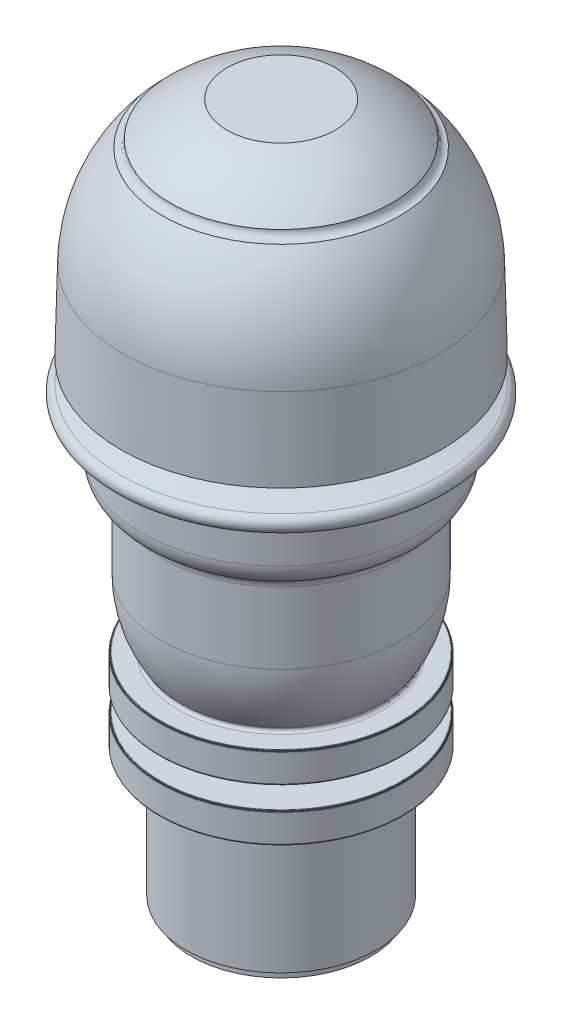
ISO-10303-21;
HEADER;
FILE_DESCRIPTION(('STEP AP214'),'2;1');
FILE_NAME('part.step','',(''),(''),'','','');
FILE_SCHEMA(('AUTOMOTIVE_DESIGN { 1 0 10303 214 1 1 1 1 }'));
ENDSEC;
DATA;
#1=APPLICATION_CONTEXT('core data for automotive mechanical design processes');
#2=APPLICATION_PROTOCOL_DEFINITION('international standard','automotive_design',2000,#1);
#3=PRODUCT_CONTEXT('',#1,'mechanical');
#4=PRODUCT('Part','Part','',(#3));
#5=PRODUCT_RELATED_PRODUCT_CATEGORY('part','',(#4));
#6=PRODUCT_DEFINITION_FORMATION('','',#4);
#7=PRODUCT_DEFINITION_CONTEXT('part definition',#1,'design');
#8=PRODUCT_DEFINITION('design','',#6,#7);
#9=PRODUCT_DEFINITION_SHAPE('','',#8);
#10=(LENGTH_UNIT() NAMED_UNIT(*) SI_UNIT(.MILLI.,.METRE.));
#11=(NAMED_UNIT(*) PLANE_ANGLE_UNIT() SI_UNIT($,.RADIAN.));
#12=(NAMED_UNIT(*) SI_UNIT($,.STERADIAN.) SOLID_ANGLE_UNIT());
#13=UNCERTAINTY_MEASURE_WITH_UNIT(LENGTH_MEASURE(1.E-05),#10,'distance_accuracy_value','');
#14=(GEOMETRIC_REPRESENTATION_CONTEXT(3) GLOBAL_UNCERTAINTY_ASSIGNED_CONTEXT((#13)) GLOBAL_UNIT_ASSIGNED_CONTEXT((#10,
#11,#12)) REPRESENTATION_CONTEXT('',''));
#15=CARTESIAN_POINT('',(0.,0.,0.));
#16=DIRECTION('',(0.,0.,1.));
#17=DIRECTION('',(1.,0.,0.));
#18=AXIS2_PLACEMENT_3D('',#15,#16,#17);
#19=CARTESIAN_POINT('',(0.,86.4,0.));
#20=DIRECTION('',(0.,1.,0.));
#21=DIRECTION('',(0.,0.,1.));
#22=AXIS2_PLACEMENT_3D('',#19,#20,#21);
#23=PLANE('',#22);
#24=CARTESIAN_POINT('',(0.,86.4,0.));
#25=DIRECTION('',(0.,-1.,0.));
#26=DIRECTION('',(0.,0.,-1.));
#27=AXIS2_PLACEMENT_3D('',#24,#25,#26);
#28=CIRCLE('',#27,16.5928828550973);
#29=CARTESIAN_POINT('',(0.,86.4,-16.5928828550973));
#30=VERTEX_POINT('',#29);
#31=EDGE_CURVE('E10',#30,#30,#28,.T.);
#32=ORIENTED_EDGE('',*,*,#31,.F.);
#33=EDGE_LOOP('',(#32));
#34=FACE_BOUND('',#33,.T.);
#35=CARTESIAN_POINT('',(0.,86.4,0.));
#36=DIRECTION('',(0.,-1.,0.));
#37=DIRECTION('',(0.,0.,-1.));
#38=AXIS2_PLACEMENT_3D('',#35,#36,#37);
#39=CIRCLE('',#38,29.1686005690508);
#40=CARTESIAN_POINT('',(0.,86.4,-29.1686005690508));
#41=VERTEX_POINT('',#40);
#42=EDGE_CURVE('E193',#41,#41,#39,.T.);
#43=ORIENTED_EDGE('',*,*,#42,.T.);
#44=EDGE_LOOP('',(#43));
#45=FACE_BOUND('',#44,.T.);
#46=ADVANCED_FACE('F36',(#34,#45),#23,.F.);
#47=CARTESIAN_POINT('',(0.,85.8,0.));
#48=DIRECTION('',(0.,-1.,0.));
#49=DIRECTION('',(0.,0.,-1.));
#50=AXIS2_PLACEMENT_3D('',#47,#48,#49);
#51=TOROIDAL_SURFACE('',#50,17.3928828550973,1.);
#52=ORIENTED_EDGE('',*,*,#31,.T.);
#53=EDGE_LOOP('',(#52));
#54=FACE_BOUND('',#53,.T.);
#55=CARTESIAN_POINT('',(0.,84.8,0.));
#56=DIRECTION('',(0.,-1.,0.));
#57=DIRECTION('',(0.,0.,-1.));
#58=AXIS2_PLACEMENT_3D('',#55,#56,#57);
#59=CIRCLE('',#58,17.3928828550973);
#60=CARTESIAN_POINT('',(0.,84.8,-17.3928828550973));
#61=VERTEX_POINT('',#60);
#62=EDGE_CURVE('E42',#61,#61,#59,.T.);
#63=ORIENTED_EDGE('',*,*,#62,.F.);
#64=EDGE_LOOP('',(#63));
#65=FACE_BOUND('',#64,.T.);
#66=ADVANCED_FACE('F210',(#54,#65),#51,.F.);
#67=CARTESIAN_POINT('',(0.,84.8,0.));
#68=DIRECTION('',(0.,1.,0.));
#69=DIRECTION('',(0.,0.,1.));
#70=AXIS2_PLACEMENT_3D('',#67,#68,#69);
#71=PLANE('',#70);
#72=ORIENTED_EDGE('',*,*,#62,.T.);
#73=EDGE_LOOP('',(#72));
#74=FACE_BOUND('',#73,.T.);
#75=CARTESIAN_POINT('',(0.,84.8,0.));
#76=DIRECTION('',(0.,-1.,0.));
#77=DIRECTION('',(0.,0.,-1.));
#78=AXIS2_PLACEMENT_3D('',#75,#76,#77);
#79=CIRCLE('',#78,20.0084396633131);
#80=CARTESIAN_POINT('',(0.,84.8,-20.0084396633131));
#81=VERTEX_POINT('',#80);
#82=EDGE_CURVE('E46',#81,#81,#79,.T.);
#83=ORIENTED_EDGE('',*,*,#82,.F.);
#84=EDGE_LOOP('',(#83));
#85=FACE_BOUND('',#84,.T.);
#86=ADVANCED_FACE('F215',(#74,#85),#71,.T.);
#87=CARTESIAN_POINT('',(0.,82.3488887394336,0.));
#88=DIRECTION('',(0.,-1.,0.));
#89=DIRECTION('',(0.,0.,-1.));
#90=AXIS2_PLACEMENT_3D('',#87,#88,#89);
#91=CONICAL_SURFACE('',#90,29.1561114227511,1.30899693899575);
#92=ORIENTED_EDGE('',*,*,#82,.T.);
#93=EDGE_LOOP('',(#92));
#94=FACE_BOUND('',#93,.T.);
#95=CARTESIAN_POINT('',(0.,82.3488887394336,0.));
#96=DIRECTION('',(0.,-1.,0.));
#97=DIRECTION('',(0.,0.,-1.));
#98=AXIS2_PLACEMENT_3D('',#95,#96,#97);
#99=CIRCLE('',#98,29.1561114227511);
#100=CARTESIAN_POINT('',(0.,82.3488887394336,-29.1561114227511));
#101=VERTEX_POINT('',#100);
#102=EDGE_CURVE('E50',#101,#101,#99,.T.);
#103=ORIENTED_EDGE('',*,*,#102,.F.);
#104=EDGE_LOOP('',(#103));
#105=FACE_BOUND('',#104,.T.);
#106=ADVANCED_FACE('F219',(#94,#105),#91,.T.);
#107=CARTESIAN_POINT('',(0.,80.9,0.));
#108=DIRECTION('',(0.,-1.,0.));
#109=DIRECTION('',(0.,0.,-1.));
#110=AXIS2_PLACEMENT_3D('',#107,#108,#109);
#111=TOROIDAL_SURFACE('',#110,28.7678828550973,1.5);
#112=CARTESIAN_POINT('',(0.,79.4511112605664,0.));
#113=DIRECTION('',(0.,-1.,0.));
#114=DIRECTION('',(0.,0.,-1.));
#115=AXIS2_PLACEMENT_3D('',#112,#113,#114);
#116=CIRCLE('',#115,28.3796542874435);
#117=CARTESIAN_POINT('',(0.,79.4511112605664,-28.3796542874435));
#118=VERTEX_POINT('',#117);
#119=EDGE_CURVE('E55',#118,#118,#116,.T.);
#120=ORIENTED_EDGE('',*,*,#119,.F.);
#121=EDGE_LOOP('',(#120));
#122=FACE_BOUND('',#121,.T.);
#123=ORIENTED_EDGE('',*,*,#102,.T.);
#124=EDGE_LOOP('',(#123));
#125=FACE_BOUND('',#124,.T.);
#126=ADVANCED_FACE('F225',(#122,#125),#111,.T.);
#127=CARTESIAN_POINT('',(0.,79.4511112605664,0.));
#128=DIRECTION('',(0.,-1.,0.));
#129=DIRECTION('',(0.,0.,-1.));
#130=AXIS2_PLACEMENT_3D('',#127,#128,#129);
#131=PLANE('',#130);
#132=ORIENTED_EDGE('',*,*,#119,.T.);
#133=EDGE_LOOP('',(#132));
#134=FACE_BOUND('',#133,.T.);
#135=CARTESIAN_POINT('',(0.,79.4511112605664,0.));
#136=DIRECTION('',(0.,-1.,0.));
#137=DIRECTION('',(0.,0.,-1.));
#138=AXIS2_PLACEMENT_3D('',#135,#136,#137);
#139=CIRCLE('',#138,22.6665233690671);
#140=CARTESIAN_POINT('',(0.,79.4511112605664,-22.6665233690671));
#141=VERTEX_POINT('',#140);
#142=EDGE_CURVE('E58',#141,#141,#139,.T.);
#143=ORIENTED_EDGE('',*,*,#142,.F.);
#144=EDGE_LOOP('',(#143));
#145=FACE_BOUND('',#144,.T.);
#146=ADVANCED_FACE('F229',(#134,#145),#131,.T.);
#147=CARTESIAN_POINT('',(0.,77.,0.));
#148=DIRECTION('',(0.,1.,0.));
#149=DIRECTION('',(0.,0.,1.));
#150=AXIS2_PLACEMENT_3D('',#147,#148,#149);
#151=CONICAL_SURFACE('',#150,22.6237390628676,0.017453292519945);
#152=ORIENTED_EDGE('',*,*,#142,.T.);
#153=EDGE_LOOP('',(#152));
#154=FACE_BOUND('',#153,.T.);
#155=CARTESIAN_POINT('',(0.,77.,0.));
#156=DIRECTION('',(0.,-1.,0.));
#157=DIRECTION('',(0.,0.,-1.));
#158=AXIS2_PLACEMENT_3D('',#155,#156,#157);
#159=CIRCLE('',#158,22.6237390628676);
#160=CARTESIAN_POINT('',(0.,77.,-22.6237390628676));
#161=VERTEX_POINT('',#160);
#162=EDGE_CURVE('E61',#161,#161,#159,.T.);
#163=ORIENTED_EDGE('',*,*,#162,.F.);
#164=EDGE_LOOP('',(#163));
#165=FACE_BOUND('',#164,.T.);
#166=ADVANCED_FACE('F233',(#154,#165),#151,.T.);
#167=CARTESIAN_POINT('',(0.,77.,0.));
#168=DIRECTION('',(0.,1.,0.));
#169=DIRECTION('',(0.,0.,1.));
#170=AXIS2_PLACEMENT_3D('',#167,#168,#169);
#171=PLANE('',#170);
#172=ORIENTED_EDGE('',*,*,#162,.T.);
#173=EDGE_LOOP('',(#172));
#174=FACE_BOUND('',#173,.T.);
#175=CARTESIAN_POINT('',(0.,77.,0.));
#176=DIRECTION('',(0.,-1.,0.));
#177=DIRECTION('',(0.,0.,-1.));
#178=AXIS2_PLACEMENT_3D('',#175,#176,#177);
#179=CIRCLE('',#178,25.4678828550973);
#180=CARTESIAN_POINT('',(0.,77.,-25.4678828550973));
#181=VERTEX_POINT('',#180);
#182=EDGE_CURVE('E64',#181,#181,#179,.T.);
#183=ORIENTED_EDGE('',*,*,#182,.F.);
#184=EDGE_LOOP('',(#183));
#185=FACE_BOUND('',#184,.T.);
#186=ADVANCED_FACE('F237',(#174,#185),#171,.T.);
#187=CARTESIAN_POINT('',(0.,0.,0.));
#188=DIRECTION('',(0.,-1.,0.));
#189=DIRECTION('',(0.,0.,-1.));
#190=AXIS2_PLACEMENT_3D('',#187,#188,#189);
#191=CYLINDRICAL_SURFACE('',#190,25.4678828550973);
#192=ORIENTED_EDGE('',*,*,#182,.T.);
#193=EDGE_LOOP('',(#192));
#194=FACE_BOUND('',#193,.T.);
#195=CARTESIAN_POINT('',(0.,71.4418746991013,0.));
#196=DIRECTION('',(0.,-1.,0.));
#197=DIRECTION('',(0.,0.,-1.));
#198=AXIS2_PLACEMENT_3D('',#195,#196,#197);
#199=CIRCLE('',#198,25.4678828550973);
#200=CARTESIAN_POINT('',(0.,71.4418746991013,-25.4678828550973));
#201=VERTEX_POINT('',#200);
#202=EDGE_CURVE('E67',#201,#201,#199,.T.);
#203=ORIENTED_EDGE('',*,*,#202,.F.);
#204=EDGE_LOOP('',(#203));
#205=FACE_BOUND('',#204,.T.);
#206=ADVANCED_FACE('F241',(#194,#205),#191,.T.);
#207=CARTESIAN_POINT('',(0.,71.4418746991013,0.));
#208=DIRECTION('',(0.,-1.,0.));
#209=DIRECTION('',(0.,0.,-1.));
#210=AXIS2_PLACEMENT_3D('',#207,#208,#209);
#211=TOROIDAL_SURFACE('',#210,20.9678828550973,4.5);
#212=CARTESIAN_POINT('',(0.,67.3974999074158,0.));
#213=DIRECTION('',(0.,-1.,0.));
#214=DIRECTION('',(0.,0.,-1.));
#215=AXIS2_PLACEMENT_3D('',#212,#213,#214);
#216=CIRCLE('',#215,22.9409597781742);
#217=CARTESIAN_POINT('',(0.,67.3974999074158,-22.9409597781742));
#218=VERTEX_POINT('',#217);
#219=EDGE_CURVE('E70',#218,#218,#216,.T.);
#220=ORIENTED_EDGE('',*,*,#219,.F.);
#221=EDGE_LOOP('',(#220));
#222=FACE_BOUND('',#221,.T.);
#223=ORIENTED_EDGE('',*,*,#202,.T.);
#224=EDGE_LOOP('',(#223));
#225=FACE_BOUND('',#224,.T.);
#226=ADVANCED_FACE('F245',(#222,#225),#211,.T.);
#227=CARTESIAN_POINT('',(0.,65.6,0.));
#228=DIRECTION('',(0.,-1.,0.));
#229=DIRECTION('',(0.,0.,-1.));
#230=AXIS2_PLACEMENT_3D('',#227,#228,#229);
#231=TOROIDAL_SURFACE('',#230,23.8178828550973,2.00000000000001);
#232=ORIENTED_EDGE('',*,*,#219,.T.);
#233=EDGE_LOOP('',(#232));
#234=FACE_BOUND('',#233,.T.);
#235=CARTESIAN_POINT('',(0.,65.6,0.));
#236=DIRECTION('',(0.,-1.,0.));
#237=DIRECTION('',(0.,0.,-1.));
#238=AXIS2_PLACEMENT_3D('',#235,#236,#237);
#239=CIRCLE('',#238,21.8178828550973);
#240=CARTESIAN_POINT('',(0.,65.6,-21.8178828550973));
#241=VERTEX_POINT('',#240);
#242=EDGE_CURVE('E73',#241,#241,#239,.T.);
#243=ORIENTED_EDGE('',*,*,#242,.F.);
#244=EDGE_LOOP('',(#243));
#245=FACE_BOUND('',#244,.T.);
#246=ADVANCED_FACE('F249',(#234,#245),#231,.F.);
#247=CARTESIAN_POINT('',(0.,0.,0.));
#248=DIRECTION('',(0.,-1.,0.));
#249=DIRECTION('',(0.,0.,-1.));
#250=AXIS2_PLACEMENT_3D('',#247,#248,#249);
#251=CYLINDRICAL_SURFACE('',#250,21.8178828550973);
#252=ORIENTED_EDGE('',*,*,#242,.T.);
#253=EDGE_LOOP('',(#252));
#254=FACE_BOUND('',#253,.T.);
#255=CARTESIAN_POINT('',(0.,52.6,0.));
#256=DIRECTION('',(0.,-1.,0.));
#257=DIRECTION('',(0.,0.,-1.));
#258=AXIS2_PLACEMENT_3D('',#255,#256,#257);
#259=CIRCLE('',#258,21.8178828550973);
#260=CARTESIAN_POINT('',(0.,52.6,-21.8178828550973));
#261=VERTEX_POINT('',#260);
#262=EDGE_CURVE('E76',#261,#261,#259,.T.);
#263=ORIENTED_EDGE('',*,*,#262,.F.);
#264=EDGE_LOOP('',(#263));
#265=FACE_BOUND('',#264,.T.);
#266=ADVANCED_FACE('F253',(#254,#265),#251,.T.);
#267=CARTESIAN_POINT('',(0.,52.6,0.));
#268=DIRECTION('',(0.,-1.,0.));
#269=DIRECTION('',(0.,0.,-1.));
#270=AXIS2_PLACEMENT_3D('',#267,#268,#269);
#271=DEGENERATE_TOROIDAL_SURFACE('',#270,0.817882855097306,21.,.T.);
#272=CARTESIAN_POINT('',(0.,40.842601268836,0.));
#273=DIRECTION('',(0.,-1.,0.));
#274=DIRECTION('',(0.,0.,-1.));
#275=AXIS2_PLACEMENT_3D('',#272,#273,#274);
#276=CIRCLE('',#275,18.2179855868752);
#277=CARTESIAN_POINT('',(0.,40.842601268836,-18.2179855868752));
#278=VERTEX_POINT('',#277);
#279=EDGE_CURVE('E79',#278,#278,#276,.T.);
#280=ORIENTED_EDGE('',*,*,#279,.F.);
#281=EDGE_LOOP('',(#280));
#282=FACE_BOUND('',#281,.T.);
#283=ORIENTED_EDGE('',*,*,#262,.T.);
#284=EDGE_LOOP('',(#283));
#285=FACE_BOUND('',#284,.T.);
#286=ADVANCED_FACE('F257',(#282,#285),#271,.T.);
#287=CARTESIAN_POINT('',(0.,40.5626632038083,0.));
#288=DIRECTION('',(0.,-1.,0.));
#289=DIRECTION('',(0.,0.,-1.));
#290=AXIS2_PLACEMENT_3D('',#287,#288,#289);
#291=TOROIDAL_SURFACE('',#290,18.6322737471556,0.500000000000004);
#292=ORIENTED_EDGE('',*,*,#279,.T.);
#293=EDGE_LOOP('',(#292));
#294=FACE_BOUND('',#293,.T.);
#295=CARTESIAN_POINT('',(0.,40.0627393562301,0.));
#296=DIRECTION('',(0.,-1.,0.));
#297=DIRECTION('',(0.,0.,-1.));
#298=AXIS2_PLACEMENT_3D('',#295,#296,#297);
#299=CIRCLE('',#298,18.6235475439369);
#300=CARTESIAN_POINT('',(0.,40.0627393562301,-18.6235475439369));
#301=VERTEX_POINT('',#300);
#302=EDGE_CURVE('E82',#301,#301,#299,.T.);
#303=ORIENTED_EDGE('',*,*,#302,.F.);
#304=EDGE_LOOP('',(#303));
#305=FACE_BOUND('',#304,.T.);
#306=ADVANCED_FACE('F261',(#294,#305),#291,.F.);
#307=CARTESIAN_POINT('',(0.,40.0055248976688,0.));
#308=DIRECTION('',(0.,-1.,0.));
#309=DIRECTION('',(0.,0.,-1.));
#310=AXIS2_PLACEMENT_3D('',#307,#308,#309);
#311=CONICAL_SURFACE('',#310,21.9013616796362,1.55334303427495);
#312=ORIENTED_EDGE('',*,*,#302,.T.);
#313=EDGE_LOOP('',(#312));
#314=FACE_BOUND('',#313,.T.);
#315=CARTESIAN_POINT('',(0.,40.0055248976688,0.));
#316=DIRECTION('',(0.,-1.,0.));
#317=DIRECTION('',(0.,0.,-1.));
#318=AXIS2_PLACEMENT_3D('',#315,#316,#317);
#319=CIRCLE('',#318,21.9013616796362);
#320=CARTESIAN_POINT('',(0.,40.0055248976688,-21.9013616796362));
#321=VERTEX_POINT('',#320);
#322=EDGE_CURVE('E85',#321,#321,#319,.T.);
#323=ORIENTED_EDGE('',*,*,#322,.F.);
#324=EDGE_LOOP('',(#323));
#325=FACE_BOUND('',#324,.T.);
#326=ADVANCED_FACE('F265',(#314,#325),#311,.T.);
#327=CARTESIAN_POINT('',(0.,40.0002670414808,0.));
#328=DIRECTION('',(0.,-1.,0.));
#329=DIRECTION('',(0.,0.,-1.));
#330=AXIS2_PLACEMENT_3D('',#327,#328,#329);
#331=CONICAL_SURFACE('',#330,21.9522864506437,1.46791335499196);
#332=ORIENTED_EDGE('',*,*,#322,.T.);
#333=EDGE_LOOP('',(#332));
#334=FACE_BOUND('',#333,.T.);
#335=CARTESIAN_POINT('',(0.,40.0002670414808,0.));
#336=DIRECTION('',(0.,-1.,0.));
#337=DIRECTION('',(0.,0.,-1.));
#338=AXIS2_PLACEMENT_3D('',#335,#336,#337);
#339=CIRCLE('',#338,21.9522864506437);
#340=CARTESIAN_POINT('',(0.,40.0002670414808,-21.9522864506437));
#341=VERTEX_POINT('',#340);
#342=EDGE_CURVE('E88',#341,#341,#339,.T.);
#343=ORIENTED_EDGE('',*,*,#342,.F.);
#344=EDGE_LOOP('',(#343));
#345=FACE_BOUND('',#344,.T.);
#346=ADVANCED_FACE('F269',(#334,#345),#331,.T.);
#347=CARTESIAN_POINT('',(0.,39.9808856316948,0.));
#348=DIRECTION('',(0.,-1.,0.));
#349=DIRECTION('',(0.,0.,-1.));
#350=AXIS2_PLACEMENT_3D('',#347,#348,#349);
#351=CONICAL_SURFACE('',#350,22.0152965385256,1.27238887314194);
#352=ORIENTED_EDGE('',*,*,#342,.T.);
#353=EDGE_LOOP('',(#352));
#354=FACE_BOUND('',#353,.T.);
#355=CARTESIAN_POINT('',(0.,39.9808856316948,0.));
#356=DIRECTION('',(0.,-1.,0.));
#357=DIRECTION('',(0.,0.,-1.));
#358=AXIS2_PLACEMENT_3D('',#355,#356,#357);
#359=CIRCLE('',#358,22.0152965385256);
#360=CARTESIAN_POINT('',(0.,39.9808856316948,-22.0152965385256));
#361=VERTEX_POINT('',#360);
#362=EDGE_CURVE('E91',#361,#361,#359,.T.);
#363=ORIENTED_EDGE('',*,*,#362,.F.);
#364=EDGE_LOOP('',(#363));
#365=FACE_BOUND('',#364,.T.);
#366=ADVANCED_FACE('F273',(#354,#365),#351,.T.);
#367=CARTESIAN_POINT('',(0.,39.9173216632381,0.));
#368=DIRECTION('',(0.,-1.,0.));
#369=DIRECTION('',(0.,0.,-1.));
#370=AXIS2_PLACEMENT_3D('',#367,#368,#369);
#371=CONICAL_SURFACE('',#370,22.1086382693734,0.972948989446623);
#372=ORIENTED_EDGE('',*,*,#362,.T.);
#373=EDGE_LOOP('',(#372));
#374=FACE_BOUND('',#373,.T.);
#375=CARTESIAN_POINT('',(0.,39.9173216632381,0.));
#376=DIRECTION('',(0.,-1.,0.));
#377=DIRECTION('',(0.,0.,-1.));
#378=AXIS2_PLACEMENT_3D('',#375,#376,#377);
#379=CIRCLE('',#378,22.1086382693734);
#380=CARTESIAN_POINT('',(0.,39.9173216632381,-22.1086382693734));
#381=VERTEX_POINT('',#380);
#382=EDGE_CURVE('E94',#381,#381,#379,.T.);
#383=ORIENTED_EDGE('',*,*,#382,.F.);
#384=EDGE_LOOP('',(#383));
#385=FACE_BOUND('',#384,.T.);
#386=ADVANCED_FACE('F277',(#374,#385),#371,.T.);
#387=CARTESIAN_POINT('',(0.,39.8198372626149,0.));
#388=DIRECTION('',(0.,-1.,0.));
#389=DIRECTION('',(0.,0.,-1.));
#390=AXIS2_PLACEMENT_3D('',#387,#388,#389);
#391=CONICAL_SURFACE('',#390,22.1735121998456,0.587180697156547);
#392=ORIENTED_EDGE('',*,*,#382,.T.);
#393=EDGE_LOOP('',(#392));
#394=FACE_BOUND('',#393,.T.);
#395=CARTESIAN_POINT('',(0.,39.8198372626149,0.));
#396=DIRECTION('',(0.,-1.,0.));
#397=DIRECTION('',(0.,0.,-1.));
#398=AXIS2_PLACEMENT_3D('',#395,#396,#397);
#399=CIRCLE('',#398,22.1735121998456);
#400=CARTESIAN_POINT('',(0.,39.8198372626149,-22.1735121998456));
#401=VERTEX_POINT('',#400);
#402=EDGE_CURVE('E97',#401,#401,#399,.T.);
#403=ORIENTED_EDGE('',*,*,#402,.F.);
#404=EDGE_LOOP('',(#403));
#405=FACE_BOUND('',#404,.T.);
#406=ADVANCED_FACE('F281',(#394,#405),#391,.T.);
#407=CARTESIAN_POINT('',(0.,39.7055705891219,0.));
#408=DIRECTION('',(0.,-1.,0.));
#409=DIRECTION('',(0.,0.,-1.));
#410=AXIS2_PLACEMENT_3D('',#407,#408,#409);
#411=CONICAL_SURFACE('',#410,22.196125957705,0.195378742997937);
#412=ORIENTED_EDGE('',*,*,#402,.T.);
#413=EDGE_LOOP('',(#412));
#414=FACE_BOUND('',#413,.T.);
#415=CARTESIAN_POINT('',(0.,39.7055705891219,0.));
#416=DIRECTION('',(0.,-1.,0.));
#417=DIRECTION('',(0.,0.,-1.));
#418=AXIS2_PLACEMENT_3D('',#415,#416,#417);
#419=CIRCLE('',#418,22.196125957705);
#420=CARTESIAN_POINT('',(0.,39.7055705891219,-22.196125957705));
#421=VERTEX_POINT('',#420);
#422=EDGE_CURVE('E100',#421,#421,#419,.T.);
#423=ORIENTED_EDGE('',*,*,#422,.F.);
#424=EDGE_LOOP('',(#423));
#425=FACE_BOUND('',#424,.T.);
#426=ADVANCED_FACE('F285',(#414,#425),#411,.T.);
#427=CARTESIAN_POINT('',(0.,0.,0.));
#428=DIRECTION('',(0.,-1.,0.));
#429=DIRECTION('',(0.,0.,-1.));
#430=AXIS2_PLACEMENT_3D('',#427,#428,#429);
#431=CYLINDRICAL_SURFACE('',#430,22.196125957705);
#432=ORIENTED_EDGE('',*,*,#422,.T.);
#433=EDGE_LOOP('',(#432));
#434=FACE_BOUND('',#433,.T.);
#435=CARTESIAN_POINT('',(0.,34.7944294108781,0.));
#436=DIRECTION('',(0.,-1.,0.));
#437=DIRECTION('',(0.,0.,-1.));
#438=AXIS2_PLACEMENT_3D('',#435,#436,#437);
#439=CIRCLE('',#438,22.196125957705);
#440=CARTESIAN_POINT('',(0.,34.7944294108781,-22.196125957705));
#441=VERTEX_POINT('',#440);
#442=EDGE_CURVE('E103',#441,#441,#439,.T.);
#443=ORIENTED_EDGE('',*,*,#442,.F.);
#444=EDGE_LOOP('',(#443));
#445=FACE_BOUND('',#444,.T.);
#446=ADVANCED_FACE('F289',(#434,#445),#431,.T.);
#447=CARTESIAN_POINT('',(0.,34.6896853430446,0.));
#448=DIRECTION('',(0.,1.,0.));
#449=DIRECTION('',(0.,0.,1.));
#450=AXIS2_PLACEMENT_3D('',#447,#448,#449);
#451=CONICAL_SURFACE('',#450,22.1772463594081,0.178330274257542);
#452=ORIENTED_EDGE('',*,*,#442,.T.);
#453=EDGE_LOOP('',(#452));
#454=FACE_BOUND('',#453,.T.);
#455=CARTESIAN_POINT('',(0.,34.6896853430446,0.));
#456=DIRECTION('',(0.,-1.,0.));
#457=DIRECTION('',(0.,0.,-1.));
#458=AXIS2_PLACEMENT_3D('',#455,#456,#457);
#459=CIRCLE('',#458,22.1772463594081);
#460=CARTESIAN_POINT('',(0.,34.6896853430446,-22.1772463594081));
#461=VERTEX_POINT('',#460);
#462=EDGE_CURVE('E106',#461,#461,#459,.T.);
#463=ORIENTED_EDGE('',*,*,#462,.F.);
#464=EDGE_LOOP('',(#463));
#465=FACE_BOUND('',#464,.T.);
#466=ADVANCED_FACE('F293',(#454,#465),#451,.T.);
#467=CARTESIAN_POINT('',(0.,34.5978693844927,0.));
#468=DIRECTION('',(0.,1.,0.));
#469=DIRECTION('',(0.,0.,1.));
#470=AXIS2_PLACEMENT_3D('',#467,#468,#469);
#471=CONICAL_SURFACE('',#470,22.122762574401,0.535553997991472);
#472=ORIENTED_EDGE('',*,*,#462,.T.);
#473=EDGE_LOOP('',(#472));
#474=FACE_BOUND('',#473,.T.);
#475=CARTESIAN_POINT('',(0.,34.5978693844927,0.));
#476=DIRECTION('',(0.,-1.,0.));
#477=DIRECTION('',(0.,0.,-1.));
#478=AXIS2_PLACEMENT_3D('',#475,#476,#477);
#479=CIRCLE('',#478,22.122762574401);
#480=CARTESIAN_POINT('',(0.,34.5978693844927,-22.122762574401));
#481=VERTEX_POINT('',#480);
#482=EDGE_CURVE('E109',#481,#481,#479,.T.);
#483=ORIENTED_EDGE('',*,*,#482,.F.);
#484=EDGE_LOOP('',(#483));
#485=FACE_BOUND('',#484,.T.);
#486=ADVANCED_FACE('F297',(#474,#485),#471,.T.);
#487=CARTESIAN_POINT('',(0.,34.52553838472,0.));
#488=DIRECTION('',(0.,1.,0.));
#489=DIRECTION('',(0.,0.,1.));
#490=AXIS2_PLACEMENT_3D('',#487,#488,#489);
#491=CONICAL_SURFACE('',#490,22.0291583449333,0.912904652505147);
#492=ORIENTED_EDGE('',*,*,#482,.T.);
#493=EDGE_LOOP('',(#492));
#494=FACE_BOUND('',#493,.T.);
#495=CARTESIAN_POINT('',(0.,34.52553838472,0.));
#496=DIRECTION('',(0.,-1.,0.));
#497=DIRECTION('',(0.,0.,-1.));
#498=AXIS2_PLACEMENT_3D('',#495,#496,#497);
#499=CIRCLE('',#498,22.0291583449333);
#500=CARTESIAN_POINT('',(0.,34.52553838472,-22.0291583449333));
#501=VERTEX_POINT('',#500);
#502=EDGE_CURVE('E112',#501,#501,#499,.T.);
#503=ORIENTED_EDGE('',*,*,#502,.F.);
#504=EDGE_LOOP('',(#503));
#505=FACE_BOUND('',#504,.T.);
#506=ADVANCED_FACE('F301',(#494,#505),#491,.T.);
#507=CARTESIAN_POINT('',(0.,34.5006329195239,0.));
#508=DIRECTION('',(0.,1.,0.));
#509=DIRECTION('',(0.,0.,1.));
#510=AXIS2_PLACEMENT_3D('',#507,#508,#509);
#511=CONICAL_SURFACE('',#510,21.9568188046308,1.23922129046299);
#512=ORIENTED_EDGE('',*,*,#502,.T.);
#513=EDGE_LOOP('',(#512));
#514=FACE_BOUND('',#513,.T.);
#515=CARTESIAN_POINT('',(0.,34.5006329195239,0.));
#516=DIRECTION('',(0.,-1.,0.));
#517=DIRECTION('',(0.,0.,-1.));
#518=AXIS2_PLACEMENT_3D('',#515,#516,#517);
#519=CIRCLE('',#518,21.9568188046308);
#520=CARTESIAN_POINT('',(0.,34.5006329195239,-21.9568188046308));
#521=VERTEX_POINT('',#520);
#522=EDGE_CURVE('E115',#521,#521,#519,.T.);
#523=ORIENTED_EDGE('',*,*,#522,.F.);
#524=EDGE_LOOP('',(#523));
#525=FACE_BOUND('',#524,.T.);
#526=ADVANCED_FACE('F305',(#514,#525),#511,.T.);
#527=CARTESIAN_POINT('',(0.,34.4944751023312,0.));
#528=DIRECTION('',(0.,1.,0.));
#529=DIRECTION('',(0.,0.,1.));
#530=AXIS2_PLACEMENT_3D('',#527,#528,#529);
#531=CONICAL_SURFACE('',#530,21.9013616796362,1.46021187882888);
#532=ORIENTED_EDGE('',*,*,#522,.T.);
#533=EDGE_LOOP('',(#532));
#534=FACE_BOUND('',#533,.T.);
#535=CARTESIAN_POINT('',(0.,34.4944751023312,0.));
#536=DIRECTION('',(0.,-1.,0.));
#537=DIRECTION('',(0.,0.,-1.));
#538=AXIS2_PLACEMENT_3D('',#535,#536,#537);
#539=CIRCLE('',#538,21.9013616796362);
#540=CARTESIAN_POINT('',(0.,34.4944751023312,-21.9013616796362));
#541=VERTEX_POINT('',#540);
#542=EDGE_CURVE('E118',#541,#541,#539,.T.);
#543=ORIENTED_EDGE('',*,*,#542,.F.);
#544=EDGE_LOOP('',(#543));
#545=FACE_BOUND('',#544,.T.);
#546=ADVANCED_FACE('F309',(#534,#545),#531,.T.);
#547=CARTESIAN_POINT('',(0.,34.3628863504472,0.));
#548=DIRECTION('',(0.,1.,0.));
#549=DIRECTION('',(0.,0.,1.));
#550=AXIS2_PLACEMENT_3D('',#547,#548,#549);
#551=CONICAL_SURFACE('',#550,14.3626471331661,1.55334303427495);
#552=ORIENTED_EDGE('',*,*,#542,.T.);
#553=EDGE_LOOP('',(#552));
#554=FACE_BOUND('',#553,.T.);
#555=CARTESIAN_POINT('',(0.,34.3628863504472,0.));
#556=DIRECTION('',(0.,-1.,0.));
#557=DIRECTION('',(0.,0.,-1.));
#558=AXIS2_PLACEMENT_3D('',#555,#556,#557);
#559=CIRCLE('',#558,14.3626471331661);
#560=CARTESIAN_POINT('',(0.,34.3628863504472,-14.3626471331661));
#561=VERTEX_POINT('',#560);
#562=EDGE_CURVE('E121',#561,#561,#559,.T.);
#563=ORIENTED_EDGE('',*,*,#562,.F.);
#564=EDGE_LOOP('',(#563));
#565=FACE_BOUND('',#564,.T.);
#566=ADVANCED_FACE('F313',(#554,#565),#551,.T.);
#567=CARTESIAN_POINT('',(0.,34.0629320419003,0.));
#568=DIRECTION('',(0.,-1.,0.));
#569=DIRECTION('',(0.,0.,-1.));
#570=AXIS2_PLACEMENT_3D('',#567,#568,#569);
#571=TOROIDAL_SURFACE('',#570,14.3678828550973,0.3);
#572=ORIENTED_EDGE('',*,*,#562,.T.);
#573=EDGE_LOOP('',(#572));
#574=FACE_BOUND('',#573,.T.);
#575=CARTESIAN_POINT('',(0.,34.0629320419003,0.));
#576=DIRECTION('',(0.,-1.,0.));
#577=DIRECTION('',(0.,0.,-1.));
#578=AXIS2_PLACEMENT_3D('',#575,#576,#577);
#579=CIRCLE('',#578,14.0678828550973);
#580=CARTESIAN_POINT('',(0.,34.0629320419003,-14.0678828550973));
#581=VERTEX_POINT('',#580);
#582=EDGE_CURVE('E124',#581,#581,#579,.T.);
#583=ORIENTED_EDGE('',*,*,#582,.F.);
#584=EDGE_LOOP('',(#583));
#585=FACE_BOUND('',#584,.T.);
#586=ADVANCED_FACE('F317',(#574,#585),#571,.F.);
#587=CARTESIAN_POINT('',(0.,0.,0.));
#588=DIRECTION('',(0.,-1.,0.));
#589=DIRECTION('',(0.,0.,-1.));
#590=AXIS2_PLACEMENT_3D('',#587,#588,#589);
#591=CYLINDRICAL_SURFACE('',#590,14.0678828550973);
#592=ORIENTED_EDGE('',*,*,#582,.T.);
#593=EDGE_LOOP('',(#592));
#594=FACE_BOUND('',#593,.T.);
#595=CARTESIAN_POINT('',(0.,30.9370679580997,0.));
#596=DIRECTION('',(0.,-1.,0.));
#597=DIRECTION('',(0.,0.,-1.));
#598=AXIS2_PLACEMENT_3D('',#595,#596,#597);
#599=CIRCLE('',#598,14.0678828550973);
#600=CARTESIAN_POINT('',(0.,30.9370679580997,-14.0678828550973));
#601=VERTEX_POINT('',#600);
#602=EDGE_CURVE('E127',#601,#601,#599,.T.);
#603=ORIENTED_EDGE('',*,*,#602,.F.);
#604=EDGE_LOOP('',(#603));
#605=FACE_BOUND('',#604,.T.);
#606=ADVANCED_FACE('F321',(#594,#605),#591,.T.);
#607=CARTESIAN_POINT('',(0.,30.9370679580997,0.));
#608=DIRECTION('',(0.,-1.,0.));
#609=DIRECTION('',(0.,0.,-1.));
#610=AXIS2_PLACEMENT_3D('',#607,#608,#609);
#611=TOROIDAL_SURFACE('',#610,14.3678828550973,0.299999999999999);
#612=ORIENTED_EDGE('',*,*,#602,.T.);
#613=EDGE_LOOP('',(#612));
#614=FACE_BOUND('',#613,.T.);
#615=CARTESIAN_POINT('',(0.,30.6371136495528,0.));
#616=DIRECTION('',(0.,-1.,0.));
#617=DIRECTION('',(0.,0.,-1.));
#618=AXIS2_PLACEMENT_3D('',#615,#616,#617);
#619=CIRCLE('',#618,14.3626471331661);
#620=CARTESIAN_POINT('',(0.,30.6371136495528,-14.3626471331661));
#621=VERTEX_POINT('',#620);
#622=EDGE_CURVE('E130',#621,#621,#619,.T.);
#623=ORIENTED_EDGE('',*,*,#622,.F.);
#624=EDGE_LOOP('',(#623));
#625=FACE_BOUND('',#624,.T.);
#626=ADVANCED_FACE('F325',(#614,#625),#611,.F.);
#627=CARTESIAN_POINT('',(0.,30.5055248976688,0.));
#628=DIRECTION('',(0.,-1.,0.));
#629=DIRECTION('',(0.,0.,-1.));
#630=AXIS2_PLACEMENT_3D('',#627,#628,#629);
#631=CONICAL_SURFACE('',#630,21.9013616796362,1.55334303427495);
#632=ORIENTED_EDGE('',*,*,#622,.T.);
#633=EDGE_LOOP('',(#632));
#634=FACE_BOUND('',#633,.T.);
#635=CARTESIAN_POINT('',(0.,30.5055248976688,0.));
#636=DIRECTION('',(0.,-1.,0.));
#637=DIRECTION('',(0.,0.,-1.));
#638=AXIS2_PLACEMENT_3D('',#635,#636,#637);
#639=CIRCLE('',#638,21.9013616796362);
#640=CARTESIAN_POINT('',(0.,30.5055248976688,-21.9013616796362));
#641=VERTEX_POINT('',#640);
#642=EDGE_CURVE('E133',#641,#641,#639,.T.);
#643=ORIENTED_EDGE('',*,*,#642,.F.);
#644=EDGE_LOOP('',(#643));
#645=FACE_BOUND('',#644,.T.);
#646=ADVANCED_FACE('F329',(#634,#645),#631,.T.);
#647=CARTESIAN_POINT('',(0.,30.5002670414807,0.));
#648=DIRECTION('',(0.,-1.,0.));
#649=DIRECTION('',(0.,0.,-1.));
#650=AXIS2_PLACEMENT_3D('',#647,#648,#649);
#651=CONICAL_SURFACE('',#650,21.9522864506438,1.46791335499174);
#652=ORIENTED_EDGE('',*,*,#642,.T.);
#653=EDGE_LOOP('',(#652));
#654=FACE_BOUND('',#653,.T.);
#655=CARTESIAN_POINT('',(0.,30.5002670414807,0.));
#656=DIRECTION('',(0.,-1.,0.));
#657=DIRECTION('',(0.,0.,-1.));
#658=AXIS2_PLACEMENT_3D('',#655,#656,#657);
#659=CIRCLE('',#658,21.9522864506438);
#660=CARTESIAN_POINT('',(0.,30.5002670414807,-21.9522864506438));
#661=VERTEX_POINT('',#660);
#662=EDGE_CURVE('E136',#661,#661,#659,.T.);
#663=ORIENTED_EDGE('',*,*,#662,.F.);
#664=EDGE_LOOP('',(#663));
#665=FACE_BOUND('',#664,.T.);
#666=ADVANCED_FACE('F333',(#654,#665),#651,.T.);
#667=CARTESIAN_POINT('',(0.,30.4808856316948,0.));
#668=DIRECTION('',(0.,-1.,0.));
#669=DIRECTION('',(0.,0.,-1.));
#670=AXIS2_PLACEMENT_3D('',#667,#668,#669);
#671=CONICAL_SURFACE('',#670,22.0152965385256,1.27238887314216);
#672=ORIENTED_EDGE('',*,*,#662,.T.);
#673=EDGE_LOOP('',(#672));
#674=FACE_BOUND('',#673,.T.);
#675=CARTESIAN_POINT('',(0.,30.4808856316948,0.));
#676=DIRECTION('',(0.,-1.,0.));
#677=DIRECTION('',(0.,0.,-1.));
#678=AXIS2_PLACEMENT_3D('',#675,#676,#677);
#679=CIRCLE('',#678,22.0152965385256);
#680=CARTESIAN_POINT('',(0.,30.4808856316948,-22.0152965385256));
#681=VERTEX_POINT('',#680);
#682=EDGE_CURVE('E139',#681,#681,#679,.T.);
#683=ORIENTED_EDGE('',*,*,#682,.F.);
#684=EDGE_LOOP('',(#683));
#685=FACE_BOUND('',#684,.T.);
#686=ADVANCED_FACE('F337',(#674,#685),#671,.T.);
#687=CARTESIAN_POINT('',(0.,30.4173216632381,0.));
#688=DIRECTION('',(0.,-1.,0.));
#689=DIRECTION('',(0.,0.,-1.));
#690=AXIS2_PLACEMENT_3D('',#687,#688,#689);
#691=CONICAL_SURFACE('',#690,22.1086382693734,0.972948989446616);
#692=ORIENTED_EDGE('',*,*,#682,.T.);
#693=EDGE_LOOP('',(#692));
#694=FACE_BOUND('',#693,.T.);
#695=CARTESIAN_POINT('',(0.,30.4173216632381,0.));
#696=DIRECTION('',(0.,-1.,0.));
#697=DIRECTION('',(0.,0.,-1.));
#698=AXIS2_PLACEMENT_3D('',#695,#696,#697);
#699=CIRCLE('',#698,22.1086382693734);
#700=CARTESIAN_POINT('',(0.,30.4173216632381,-22.1086382693734));
#701=VERTEX_POINT('',#700);
#702=EDGE_CURVE('E142',#701,#701,#699,.T.);
#703=ORIENTED_EDGE('',*,*,#702,.F.);
#704=EDGE_LOOP('',(#703));
#705=FACE_BOUND('',#704,.T.);
#706=ADVANCED_FACE('F341',(#694,#705),#691,.T.);
#707=CARTESIAN_POINT('',(0.,30.319837262615,0.));
#708=DIRECTION('',(0.,-1.,0.));
#709=DIRECTION('',(0.,0.,-1.));
#710=AXIS2_PLACEMENT_3D('',#707,#708,#709);
#711=CONICAL_SURFACE('',#710,22.1735121998456,0.587180697156777);
#712=ORIENTED_EDGE('',*,*,#702,.T.);
#713=EDGE_LOOP('',(#712));
#714=FACE_BOUND('',#713,.T.);
#715=CARTESIAN_POINT('',(0.,30.319837262615,0.));
#716=DIRECTION('',(0.,-1.,0.));
#717=DIRECTION('',(0.,0.,-1.));
#718=AXIS2_PLACEMENT_3D('',#715,#716,#717);
#719=CIRCLE('',#718,22.1735121998456);
#720=CARTESIAN_POINT('',(0.,30.319837262615,-22.1735121998456));
#721=VERTEX_POINT('',#720);
#722=EDGE_CURVE('E145',#721,#721,#719,.T.);
#723=ORIENTED_EDGE('',*,*,#722,.F.);
#724=EDGE_LOOP('',(#723));
#725=FACE_BOUND('',#724,.T.);
#726=ADVANCED_FACE('F345',(#714,#725),#711,.T.);
#727=CARTESIAN_POINT('',(0.,30.2055705891219,0.));
#728=DIRECTION('',(0.,-1.,0.));
#729=DIRECTION('',(0.,0.,-1.));
#730=AXIS2_PLACEMENT_3D('',#727,#728,#729);
#731=CONICAL_SURFACE('',#730,22.196125957705,0.195378742997932);
#732=ORIENTED_EDGE('',*,*,#722,.T.);
#733=EDGE_LOOP('',(#732));
#734=FACE_BOUND('',#733,.T.);
#735=CARTESIAN_POINT('',(0.,30.2055705891219,0.));
#736=DIRECTION('',(0.,-1.,0.));
#737=DIRECTION('',(0.,0.,-1.));
#738=AXIS2_PLACEMENT_3D('',#735,#736,#737);
#739=CIRCLE('',#738,22.196125957705);
#740=CARTESIAN_POINT('',(0.,30.2055705891219,-22.196125957705));
#741=VERTEX_POINT('',#740);
#742=EDGE_CURVE('E148',#741,#741,#739,.T.);
#743=ORIENTED_EDGE('',*,*,#742,.F.);
#744=EDGE_LOOP('',(#743));
#745=FACE_BOUND('',#744,.T.);
#746=ADVANCED_FACE('F349',(#734,#745),#731,.T.);
#747=CARTESIAN_POINT('',(0.,0.,0.));
#748=DIRECTION('',(0.,-1.,0.));
#749=DIRECTION('',(0.,0.,-1.));
#750=AXIS2_PLACEMENT_3D('',#747,#748,#749);
#751=CYLINDRICAL_SURFACE('',#750,22.196125957705);
#752=ORIENTED_EDGE('',*,*,#742,.T.);
#753=EDGE_LOOP('',(#752));
#754=FACE_BOUND('',#753,.T.);
#755=CARTESIAN_POINT('',(0.,25.2944294108781,0.));
#756=DIRECTION('',(0.,-1.,0.));
#757=DIRECTION('',(0.,0.,-1.));
#758=AXIS2_PLACEMENT_3D('',#755,#756,#757);
#759=CIRCLE('',#758,22.1961259577051);
#760=CARTESIAN_POINT('',(0.,25.2944294108781,-22.1961259577051));
#761=VERTEX_POINT('',#760);
#762=EDGE_CURVE('E151',#761,#761,#759,.T.);
#763=ORIENTED_EDGE('',*,*,#762,.F.);
#764=EDGE_LOOP('',(#763));
#765=FACE_BOUND('',#764,.T.);
#766=ADVANCED_FACE('F353',(#754,#765),#751,.T.);
#767=CARTESIAN_POINT('',(0.,25.1896853430447,0.));
#768=DIRECTION('',(0.,1.,0.));
#769=DIRECTION('',(0.,0.,1.));
#770=AXIS2_PLACEMENT_3D('',#767,#768,#769);
#771=CONICAL_SURFACE('',#770,22.1772463594081,0.178330274257391);
#772=ORIENTED_EDGE('',*,*,#762,.T.);
#773=EDGE_LOOP('',(#772));
#774=FACE_BOUND('',#773,.T.);
#775=CARTESIAN_POINT('',(0.,25.1896853430447,0.));
#776=DIRECTION('',(0.,-1.,0.));
#777=DIRECTION('',(0.,0.,-1.));
#778=AXIS2_PLACEMENT_3D('',#775,#776,#777);
#779=CIRCLE('',#778,22.1772463594081);
#780=CARTESIAN_POINT('',(0.,25.1896853430447,-22.1772463594081));
#781=VERTEX_POINT('',#780);
#782=EDGE_CURVE('E154',#781,#781,#779,.T.);
#783=ORIENTED_EDGE('',*,*,#782,.F.);
#784=EDGE_LOOP('',(#783));
#785=FACE_BOUND('',#784,.T.);
#786=ADVANCED_FACE('F357',(#774,#785),#771,.T.);
#787=CARTESIAN_POINT('',(0.,25.0978693844928,0.));
#788=DIRECTION('',(0.,1.,0.));
#789=DIRECTION('',(0.,0.,1.));
#790=AXIS2_PLACEMENT_3D('',#787,#788,#789);
#791=CONICAL_SURFACE('',#790,22.1227625744011,0.53555399799102);
#792=ORIENTED_EDGE('',*,*,#782,.T.);
#793=EDGE_LOOP('',(#792));
#794=FACE_BOUND('',#793,.T.);
#795=CARTESIAN_POINT('',(0.,25.0978693844928,0.));
#796=DIRECTION('',(0.,-1.,0.));
#797=DIRECTION('',(0.,0.,-1.));
#798=AXIS2_PLACEMENT_3D('',#795,#796,#797);
#799=CIRCLE('',#798,22.1227625744011);
#800=CARTESIAN_POINT('',(0.,25.0978693844928,-22.1227625744011));
#801=VERTEX_POINT('',#800);
#802=EDGE_CURVE('E157',#801,#801,#799,.T.);
#803=ORIENTED_EDGE('',*,*,#802,.F.);
#804=EDGE_LOOP('',(#803));
#805=FACE_BOUND('',#804,.T.);
#806=ADVANCED_FACE('F361',(#794,#805),#791,.T.);
#807=CARTESIAN_POINT('',(0.,25.0255383847201,0.));
#808=DIRECTION('',(0.,1.,0.));
#809=DIRECTION('',(0.,0.,1.));
#810=AXIS2_PLACEMENT_3D('',#807,#808,#809);
#811=CONICAL_SURFACE('',#810,22.0291583449334,0.912904652504792);
#812=ORIENTED_EDGE('',*,*,#802,.T.);
#813=EDGE_LOOP('',(#812));
#814=FACE_BOUND('',#813,.T.);
#815=CARTESIAN_POINT('',(0.,25.0255383847201,0.));
#816=DIRECTION('',(0.,-1.,0.));
#817=DIRECTION('',(0.,0.,-1.));
#818=AXIS2_PLACEMENT_3D('',#815,#816,#817);
#819=CIRCLE('',#818,22.0291583449334);
#820=CARTESIAN_POINT('',(0.,25.0255383847201,-22.0291583449334));
#821=VERTEX_POINT('',#820);
#822=EDGE_CURVE('E160',#821,#821,#819,.T.);
#823=ORIENTED_EDGE('',*,*,#822,.F.);
#824=EDGE_LOOP('',(#823));
#825=FACE_BOUND('',#824,.T.);
#826=ADVANCED_FACE('F365',(#814,#825),#811,.T.);
#827=CARTESIAN_POINT('',(0.,25.0006329195239,0.));
#828=DIRECTION('',(0.,1.,0.));
#829=DIRECTION('',(0.,0.,1.));
#830=AXIS2_PLACEMENT_3D('',#827,#828,#829);
#831=CONICAL_SURFACE('',#830,21.9568188046309,1.23922129046259);
#832=ORIENTED_EDGE('',*,*,#822,.T.);
#833=EDGE_LOOP('',(#832));
#834=FACE_BOUND('',#833,.T.);
#835=CARTESIAN_POINT('',(0.,25.0006329195239,0.));
#836=DIRECTION('',(0.,-1.,0.));
#837=DIRECTION('',(0.,0.,-1.));
#838=AXIS2_PLACEMENT_3D('',#835,#836,#837);
#839=CIRCLE('',#838,21.9568188046309);
#840=CARTESIAN_POINT('',(0.,25.0006329195239,-21.9568188046309));
#841=VERTEX_POINT('',#840);
#842=EDGE_CURVE('E163',#841,#841,#839,.T.);
#843=ORIENTED_EDGE('',*,*,#842,.F.);
#844=EDGE_LOOP('',(#843));
#845=FACE_BOUND('',#844,.T.);
#846=ADVANCED_FACE('F369',(#834,#845),#831,.T.);
#847=CARTESIAN_POINT('',(0.,24.9944751023312,0.));
#848=DIRECTION('',(0.,1.,0.));
#849=DIRECTION('',(0.,0.,1.));
#850=AXIS2_PLACEMENT_3D('',#847,#848,#849);
#851=CONICAL_SURFACE('',#850,21.9013616796362,1.460211878829);
#852=ORIENTED_EDGE('',*,*,#842,.T.);
#853=EDGE_LOOP('',(#852));
#854=FACE_BOUND('',#853,.T.);
#855=CARTESIAN_POINT('',(0.,24.9944751023312,0.));
#856=DIRECTION('',(0.,-1.,0.));
#857=DIRECTION('',(0.,0.,-1.));
#858=AXIS2_PLACEMENT_3D('',#855,#856,#857);
#859=CIRCLE('',#858,21.9013616796362);
#860=CARTESIAN_POINT('',(0.,24.9944751023312,-21.9013616796362));
#861=VERTEX_POINT('',#860);
#862=EDGE_CURVE('E166',#861,#861,#859,.T.);
#863=ORIENTED_EDGE('',*,*,#862,.F.);
#864=EDGE_LOOP('',(#863));
#865=FACE_BOUND('',#864,.T.);
#866=ADVANCED_FACE('F373',(#854,#865),#851,.T.);
#867=CARTESIAN_POINT('',(0.,24.9144701818517,0.));
#868=DIRECTION('',(0.,1.,0.));
#869=DIRECTION('',(0.,0.,1.));
#870=AXIS2_PLACEMENT_3D('',#867,#868,#869);
#871=CONICAL_SURFACE('',#870,17.3178828550973,1.55334303427495);
#872=ORIENTED_EDGE('',*,*,#862,.T.);
#873=EDGE_LOOP('',(#872));
#874=FACE_BOUND('',#873,.T.);
#875=CARTESIAN_POINT('',(0.,24.9144701818517,0.));
#876=DIRECTION('',(0.,-1.,0.));
#877=DIRECTION('',(0.,0.,-1.));
#878=AXIS2_PLACEMENT_3D('',#875,#876,#877);
#879=CIRCLE('',#878,17.3178828550973);
#880=CARTESIAN_POINT('',(0.,24.9144701818517,-17.3178828550973));
#881=VERTEX_POINT('',#880);
#882=EDGE_CURVE('E169',#881,#881,#879,.T.);
#883=ORIENTED_EDGE('',*,*,#882,.F.);
#884=EDGE_LOOP('',(#883));
#885=FACE_BOUND('',#884,.T.);
#886=ADVANCED_FACE('F377',(#874,#885),#871,.T.);
#887=CARTESIAN_POINT('',(0.,0.,0.));
#888=DIRECTION('',(0.,-1.,0.));
#889=DIRECTION('',(0.,0.,-1.));
#890=AXIS2_PLACEMENT_3D('',#887,#888,#889);
#891=CYLINDRICAL_SURFACE('',#890,17.3178828550973);
#892=ORIENTED_EDGE('',*,*,#882,.T.);
#893=EDGE_LOOP('',(#892));
#894=FACE_BOUND('',#893,.T.);
#895=CARTESIAN_POINT('',(0.,1.50000000000001,0.));
#896=DIRECTION('',(0.,-1.,0.));
#897=DIRECTION('',(0.,0.,-1.));
#898=AXIS2_PLACEMENT_3D('',#895,#896,#897);
#899=CIRCLE('',#898,17.3178828550973);
#900=CARTESIAN_POINT('',(0.,1.50000000000001,-17.3178828550973));
#901=VERTEX_POINT('',#900);
#902=EDGE_CURVE('E172',#901,#901,#899,.T.);
#903=ORIENTED_EDGE('',*,*,#902,.F.);
#904=EDGE_LOOP('',(#903));
#905=FACE_BOUND('',#904,.T.);
#906=ADVANCED_FACE('F381',(#894,#905),#891,.T.);
#907=CARTESIAN_POINT('',(0.,1.50000000000001,0.));
#908=DIRECTION('',(0.,1.,0.));
#909=DIRECTION('',(0.,0.,1.));
#910=AXIS2_PLACEMENT_3D('',#907,#908,#909);
#911=PLANE('',#910);
#912=CARTESIAN_POINT('',(0.,1.50000000000001,0.));
#913=DIRECTION('',(0.,-1.,0.));
#914=DIRECTION('',(0.,0.,-1.));
#915=AXIS2_PLACEMENT_3D('',#912,#913,#914);
#916=CIRCLE('',#915,16.3178828550973);
#917=CARTESIAN_POINT('',(0.,1.50000000000001,-16.3178828550973));
#918=VERTEX_POINT('',#917);
#919=EDGE_CURVE('E175',#918,#918,#916,.T.);
#920=ORIENTED_EDGE('',*,*,#919,.F.);
#921=EDGE_LOOP('',(#920));
#922=FACE_BOUND('',#921,.T.);
#923=ORIENTED_EDGE('',*,*,#902,.T.);
#924=EDGE_LOOP('',(#923));
#925=FACE_BOUND('',#924,.T.);
#926=ADVANCED_FACE('F385',(#922,#925),#911,.F.);
#927=CARTESIAN_POINT('',(0.,0.,0.));
#928=DIRECTION('',(0.,-1.,0.));
#929=DIRECTION('',(0.,0.,-1.));
#930=AXIS2_PLACEMENT_3D('',#927,#928,#929);
#931=CYLINDRICAL_SURFACE('',#930,16.3178828550973);
#932=ORIENTED_EDGE('',*,*,#919,.T.);
#933=EDGE_LOOP('',(#932));
#934=FACE_BOUND('',#933,.T.);
#935=CARTESIAN_POINT('',(0.,0.,0.));
#936=DIRECTION('',(0.,-1.,0.));
#937=DIRECTION('',(0.,0.,-1.));
#938=AXIS2_PLACEMENT_3D('',#935,#936,#937);
#939=CIRCLE('',#938,16.3178828550973);
#940=CARTESIAN_POINT('',(0.,0.,-16.3178828550973));
#941=VERTEX_POINT('',#940);
#942=EDGE_CURVE('E178',#941,#941,#939,.T.);
#943=ORIENTED_EDGE('',*,*,#942,.F.);
#944=EDGE_LOOP('',(#943));
#945=FACE_BOUND('',#944,.T.);
#946=ADVANCED_FACE('F389',(#934,#945),#931,.T.);
#947=CARTESIAN_POINT('',(0.,0.,0.));
#948=DIRECTION('',(0.,-1.,0.));
#949=DIRECTION('',(0.,0.,-1.));
#950=AXIS2_PLACEMENT_3D('',#947,#948,#949);
#951=PLANE('',#950);
#952=ORIENTED_EDGE('',*,*,#942,.T.);
#953=EDGE_LOOP('',(#952));
#954=FACE_BOUND('',#953,.T.);
#955=ADVANCED_FACE('F393',(#954),#951,.T.);
#956=CARTESIAN_POINT('',(0.,127.2,0.));
#957=DIRECTION('',(0.,-1.,0.));
#958=DIRECTION('',(0.,0.,-1.));
#959=AXIS2_PLACEMENT_3D('',#956,#957,#958);
#960=PLANE('',#959);
#961=CARTESIAN_POINT('',(0.,127.2,0.));
#962=DIRECTION('',(0.,-1.,0.));
#963=DIRECTION('',(0.,0.,-1.));
#964=AXIS2_PLACEMENT_3D('',#961,#962,#963);
#965=CIRCLE('',#964,9.85945351510985);
#966=CARTESIAN_POINT('',(0.,127.2,-9.85945351510985));
#967=VERTEX_POINT('',#966);
#968=EDGE_CURVE('E181',#967,#967,#965,.T.);
#969=ORIENTED_EDGE('',*,*,#968,.F.);
#970=EDGE_LOOP('',(#969));
#971=FACE_BOUND('',#970,.T.);
#972=ADVANCED_FACE('F397',(#971),#960,.F.);
#973=CARTESIAN_POINT('',(0.,100.7,0.));
#974=DIRECTION('',(0.,-1.,0.));
#975=DIRECTION('',(0.,0.,-1.));
#976=AXIS2_PLACEMENT_3D('',#973,#974,#975);
#977=DEGENERATE_TOROIDAL_SURFACE('',#976,0.817882855097281,28.,.T.);
#978=CARTESIAN_POINT('',(0.,120.890062694008,0.));
#979=DIRECTION('',(0.,-1.,0.));
#980=DIRECTION('',(0.,0.,-1.));
#981=AXIS2_PLACEMENT_3D('',#978,#979,#980);
#982=CIRCLE('',#981,20.2179181234167);
#983=CARTESIAN_POINT('',(0.,120.890062694008,-20.2179181234167));
#984=VERTEX_POINT('',#983);
#985=EDGE_CURVE('E184',#984,#984,#982,.T.);
#986=ORIENTED_EDGE('',*,*,#985,.F.);
#987=EDGE_LOOP('',(#986));
#988=FACE_BOUND('',#987,.T.);
#989=ORIENTED_EDGE('',*,*,#968,.T.);
#990=EDGE_LOOP('',(#989));
#991=FACE_BOUND('',#990,.T.);
#992=ADVANCED_FACE('F401',(#988,#991),#977,.T.);
#993=CARTESIAN_POINT('',(0.,120.9,0.));
#994=DIRECTION('',(0.,-1.,0.));
#995=DIRECTION('',(0.,0.,-1.));
#996=AXIS2_PLACEMENT_3D('',#993,#994,#995);
#997=TOROIDAL_SURFACE('',#996,21.6178828550973,1.4);
#998=ORIENTED_EDGE('',*,*,#985,.T.);
#999=EDGE_LOOP('',(#998));
#1000=FACE_BOUND('',#999,.T.);
#1001=CARTESIAN_POINT('',(0.,119.500925553601,0.));
#1002=DIRECTION('',(0.,-1.,0.));
#1003=DIRECTION('',(0.,0.,-1.));
#1004=AXIS2_PLACEMENT_3D('',#1001,#1002,#1003);
#1005=CIRCLE('',#1004,21.5669840001576);
#1006=CARTESIAN_POINT('',(0.,119.500925553601,-21.5669840001576));
#1007=VERTEX_POINT('',#1006);
#1008=EDGE_CURVE('E187',#1007,#1007,#1005,.T.);
#1009=ORIENTED_EDGE('',*,*,#1008,.F.);
#1010=EDGE_LOOP('',(#1009));
#1011=FACE_BOUND('',#1010,.T.);
#1012=ADVANCED_FACE('F206',(#1000,#1011),#997,.F.);
#1013=CARTESIAN_POINT('',(0.,100.7,0.));
#1014=DIRECTION('',(0.,-1.,0.));
#1015=DIRECTION('',(0.,0.,-1.));
#1016=AXIS2_PLACEMENT_3D('',#1013,#1014,#1015);
#1017=DEGENERATE_TOROIDAL_SURFACE('',#1016,0.817882855097281,28.,.T.);
#1018=CARTESIAN_POINT('',(0.,101.370787908623,0.));
#1019=DIRECTION('',(0.,-1.,0.));
#1020=DIRECTION('',(0.,0.,-1.));
#1021=AXIS2_PLACEMENT_3D('',#1018,#1019,#1020);
#1022=CIRCLE('',#1021,28.8098467658636);
#1023=CARTESIAN_POINT('',(0.,101.370787908623,-28.8098467658636));
#1024=VERTEX_POINT('',#1023);
#1025=EDGE_CURVE('E190',#1024,#1024,#1022,.T.);
#1026=ORIENTED_EDGE('',*,*,#1025,.F.);
#1027=EDGE_LOOP('',(#1026));
#1028=FACE_BOUND('',#1027,.T.);
#1029=ORIENTED_EDGE('',*,*,#1008,.T.);
#1030=EDGE_LOOP('',(#1029));
#1031=FACE_BOUND('',#1030,.T.);
#1032=ADVANCED_FACE('F200',(#1028,#1031),#1017,.T.);
#1033=CARTESIAN_POINT('',(0.,86.4,0.));
#1034=DIRECTION('',(0.,-1.,0.));
#1035=DIRECTION('',(0.,0.,-1.));
#1036=AXIS2_PLACEMENT_3D('',#1033,#1034,#1035);
#1037=CONICAL_SURFACE('',#1036,29.1686005690508,0.0239590031695343);
#1038=ORIENTED_EDGE('',*,*,#1025,.T.);
#1039=EDGE_LOOP('',(#1038));
#1040=FACE_BOUND('',#1039,.T.);
#1041=ORIENTED_EDGE('',*,*,#42,.F.);
#1042=EDGE_LOOP('',(#1041));
#1043=FACE_BOUND('',#1042,.T.);
#1044=ADVANCED_FACE('F198',(#1040,#1043),#1037,.T.);
#1045=CLOSED_SHELL('',(#46,#66,#86,#106,#126,#146,#166,#186,#206,#226,#246,#266,#286,#306,#326,
#346,#366,#386,#406,#426,#446,#466,#486,#506,#526,#546,#566,#586,#606,#626,#646,#666,#686,#706,
#726,#746,#766,#786,#806,#826,#846,#866,#886,#906,#926,#946,#955,#972,#992,#1012,#1032,#1044));
#1046=MANIFOLD_SOLID_BREP('B2',#1045);
#1047=ADVANCED_BREP_SHAPE_REPRESENTATION('',(#18,#1046),#14);
#1048=SHAPE_DEFINITION_REPRESENTATION(#9,#1047);
ENDSEC;
END-ISO-10303-21;
